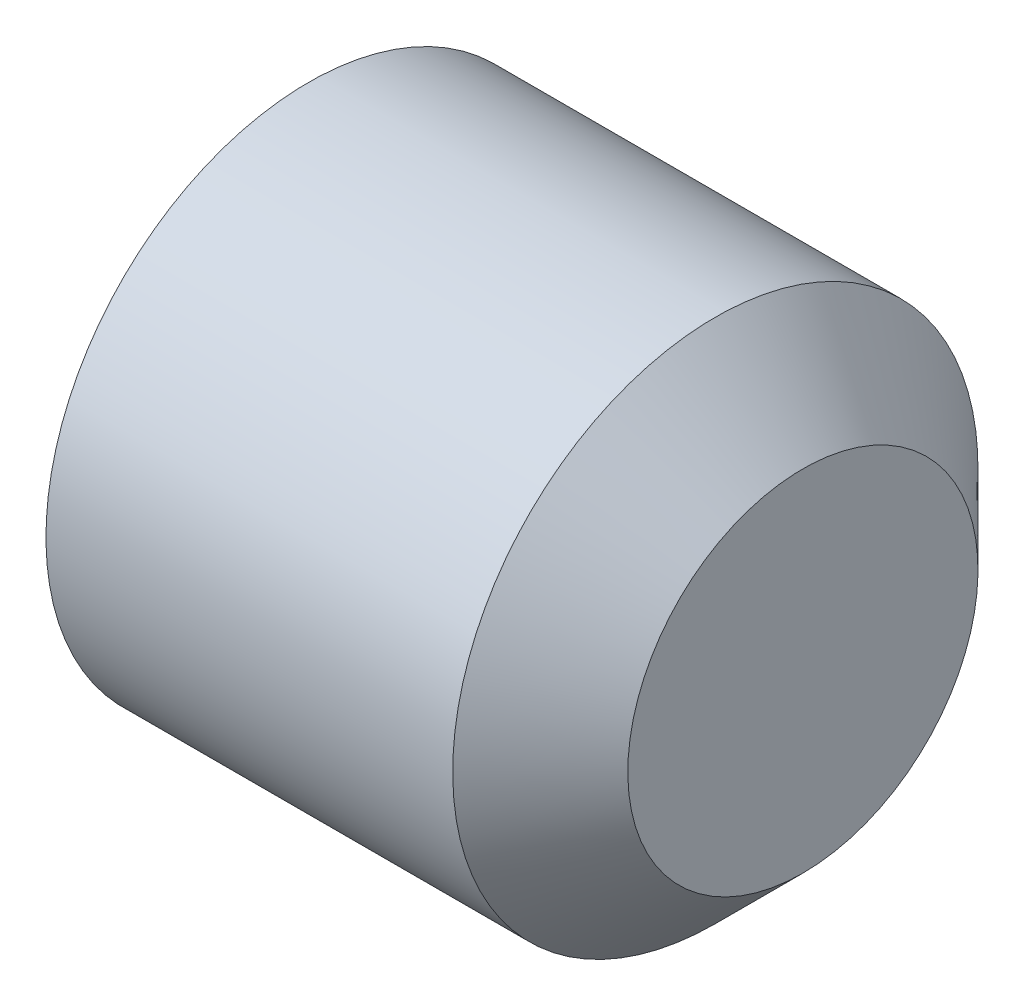
ISO-10303-21;
HEADER;
FILE_DESCRIPTION(('STEP AP214'),'2;1');
FILE_NAME('part.step','',(''),(''),'','','');
FILE_SCHEMA(('AUTOMOTIVE_DESIGN { 1 0 10303 214 1 1 1 1 }'));
ENDSEC;
DATA;
#1=APPLICATION_CONTEXT('core data for automotive mechanical design processes');
#2=APPLICATION_PROTOCOL_DEFINITION('international standard','automotive_design',2000,#1);
#3=PRODUCT_CONTEXT('',#1,'mechanical');
#4=PRODUCT('Part','Part','',(#3));
#5=PRODUCT_RELATED_PRODUCT_CATEGORY('part','',(#4));
#6=PRODUCT_DEFINITION_FORMATION('','',#4);
#7=PRODUCT_DEFINITION_CONTEXT('part definition',#1,'design');
#8=PRODUCT_DEFINITION('design','',#6,#7);
#9=PRODUCT_DEFINITION_SHAPE('','',#8);
#10=(LENGTH_UNIT() NAMED_UNIT(*) SI_UNIT(.MILLI.,.METRE.));
#11=(NAMED_UNIT(*) PLANE_ANGLE_UNIT() SI_UNIT($,.RADIAN.));
#12=(NAMED_UNIT(*) SI_UNIT($,.STERADIAN.) SOLID_ANGLE_UNIT());
#13=UNCERTAINTY_MEASURE_WITH_UNIT(LENGTH_MEASURE(1.E-05),#10,'distance_accuracy_value','');
#14=(GEOMETRIC_REPRESENTATION_CONTEXT(3) GLOBAL_UNCERTAINTY_ASSIGNED_CONTEXT((#13)) GLOBAL_UNIT_ASSIGNED_CONTEXT((#10,
#11,#12)) REPRESENTATION_CONTEXT('',''));
#15=CARTESIAN_POINT('',(0.,0.,0.));
#16=DIRECTION('',(0.,0.,1.));
#17=DIRECTION('',(1.,0.,0.));
#18=AXIS2_PLACEMENT_3D('',#15,#16,#17);
#19=CARTESIAN_POINT('',(0.5,0.,0.));
#20=DIRECTION('',(-1.,0.,0.));
#21=DIRECTION('',(0.,-1.,0.));
#22=AXIS2_PLACEMENT_3D('',#19,#20,#21);
#23=CONICAL_SURFACE('',#22,0.,1.0471975511966);
#24=CARTESIAN_POINT('',(0.,0.,0.));
#25=DIRECTION('',(-1.,0.,0.));
#26=DIRECTION('',(0.,-1.,0.));
#27=AXIS2_PLACEMENT_3D('',#24,#25,#26);
#28=CIRCLE('',#27,0.86602540378444);
#29=CARTESIAN_POINT('',(0.,0.,0.86602540378444));
#30=VERTEX_POINT('',#29);
#31=CARTESIAN_POINT('',(0.,0.75,0.433012701892222));
#32=VERTEX_POINT('',#31);
#33=EDGE_CURVE('E133',#30,#32,#28,.T.);
#34=ORIENTED_EDGE('',*,*,#33,.T.);
#35=CARTESIAN_POINT('',(-6.66799982216302E-05,0.7502,0.432897231838382));
#36=CARTESIAN_POINT('',(0.0109279672545947,0.717238666576004,0.451927466563575));
#37=CARTESIAN_POINT('',(0.0209278588304373,0.68399281869625,0.471121965786389));
#38=CARTESIAN_POINT('',(0.038384288073924,0.616925218141244,0.509843463020724));
#39=CARTESIAN_POINT('',(0.0458346476710156,0.583102272153654,0.529371149991445));
#40=CARTESIAN_POINT('',(0.0574342962607426,0.515875632570363,0.568184468451572));
#41=CARTESIAN_POINT('',(0.0616607517951379,0.482482293499614,0.58746412175321));
#42=CARTESIAN_POINT('',(0.0667098540533308,0.415538173911306,0.626114327218181));
#43=CARTESIAN_POINT('',(0.0675366780658326,0.381987637355588,0.645484738530082));
#44=CARTESIAN_POINT('',(0.065833231960248,0.319275698978884,0.681691493033275));
#45=CARTESIAN_POINT('',(0.0637212206264606,0.290104995811374,0.698533206359488));
#46=CARTESIAN_POINT('',(0.0570222121958374,0.231953671848458,0.73210688890321));
#47=CARTESIAN_POINT('',(0.0524329180465318,0.202973252776875,0.748838741655417));
#48=CARTESIAN_POINT('',(0.0409580031195664,0.144701650655193,0.782481866826481));
#49=CARTESIAN_POINT('',(0.0340236523302114,0.115417857581381,0.79938887264054));
#50=CARTESIAN_POINT('',(0.0182846224056368,0.0572874895838319,0.832950456252017));
#51=CARTESIAN_POINT('',(0.00948365081374576,0.0284401676519287,0.849605465334801));
#52=CARTESIAN_POINT('',(-6.66799982220191E-05,-0.000199999999999903,0.866140873838278));
#53=B_SPLINE_CURVE_WITH_KNOTS('',3,(#35,#36,#37,#38,#39,#40,#41,#42,#43,#44,#45,#46,#47,#48,#49,
#50,#51,#52),.UNSPECIFIED.,.F.,.F.,(4,2,2,2,2,2,2,2,4),(0.,0.118896819359341,0.238079744533805,
0.354311719456401,0.470400831872515,0.571553114284105,0.672799351342655,0.776293900714049,
0.87958477934405),.UNSPECIFIED.);
#54=EDGE_CURVE('E11',#32,#30,#53,.T.);
#55=ORIENTED_EDGE('',*,*,#54,.T.);
#56=EDGE_LOOP('',(#34,#55));
#57=FACE_BOUND('',#56,.T.);
#58=ADVANCED_FACE('F31',(#57),#23,.F.);
#59=CARTESIAN_POINT('',(0.,-0.75,0.43301270189222));
#60=VERTEX_POINT('',#59);
#61=EDGE_CURVE('E129',#60,#30,#28,.T.);
#62=ORIENTED_EDGE('',*,*,#61,.T.);
#63=CARTESIAN_POINT('',(-6.66799982221631E-05,0.000200000000000009,0.866140873838278));
#64=CARTESIAN_POINT('',(0.0109279672545943,-0.0327613334239957,0.847110639113085));
#65=CARTESIAN_POINT('',(0.0209278588304369,-0.0660071813037502,0.827916139890271));
#66=CARTESIAN_POINT('',(0.0383842880739238,-0.133074781858756,0.789194642655936));
#67=CARTESIAN_POINT('',(0.0458346476710154,-0.166897727846346,0.769666955685215));
#68=CARTESIAN_POINT('',(0.0574342962607425,-0.234124367429637,0.730853637225088));
#69=CARTESIAN_POINT('',(0.0616607517951379,-0.267517706500387,0.71157398392345));
#70=CARTESIAN_POINT('',(0.0667098540533308,-0.334461826088694,0.672923778458478));
#71=CARTESIAN_POINT('',(0.0675366780658327,-0.368012362644413,0.653553367146578));
#72=CARTESIAN_POINT('',(0.0658332319602481,-0.430724301021117,0.617346612643384));
#73=CARTESIAN_POINT('',(0.0637212206264609,-0.459895004188626,0.600504899317172));
#74=CARTESIAN_POINT('',(0.0570222121958376,-0.518046328151543,0.566931216773449));
#75=CARTESIAN_POINT('',(0.0524329180465321,-0.547026747223125,0.550199364021243));
#76=CARTESIAN_POINT('',(0.0409580031195668,-0.605298349344807,0.516556238850179));
#77=CARTESIAN_POINT('',(0.0340236523302119,-0.634582142418619,0.49964923303612));
#78=CARTESIAN_POINT('',(0.0182846224056374,-0.692712510416168,0.466087649424643));
#79=CARTESIAN_POINT('',(0.00948365081374636,-0.721559832348072,0.449432640341859));
#80=CARTESIAN_POINT('',(-6.6679998221416E-05,-0.7502,0.432897231838382));
#81=B_SPLINE_CURVE_WITH_KNOTS('',3,(#63,#64,#65,#66,#67,#68,#69,#70,#71,#72,#73,#74,#75,#76,#77,
#78,#79,#80),.UNSPECIFIED.,.F.,.F.,(4,2,2,2,2,2,2,2,4),(0.,0.118896819359341,0.238079744533806,
0.354311719456402,0.470400831872516,0.571553114284106,0.672799351342656,0.776293900714049,
0.87958477934405),.UNSPECIFIED.);
#82=EDGE_CURVE('E44',#30,#60,#81,.T.);
#83=ORIENTED_EDGE('',*,*,#82,.T.);
#84=EDGE_LOOP('',(#62,#83));
#85=FACE_BOUND('',#84,.T.);
#86=ADVANCED_FACE('F199',(#85),#23,.F.);
#87=CARTESIAN_POINT('',(0.,-0.75,-0.43301270189222));
#88=VERTEX_POINT('',#87);
#89=EDGE_CURVE('E128',#88,#60,#28,.T.);
#90=ORIENTED_EDGE('',*,*,#89,.T.);
#91=CARTESIAN_POINT('',(-0.278876466554599,-0.75,-1.1213588410753));
#92=CARTESIAN_POINT('',(-0.263336265513847,-0.75,-1.08897094569566));
#93=CARTESIAN_POINT('',(-0.247960254101356,-0.75,-1.05650461769235));
#94=CARTESIAN_POINT('',(-0.217622574828427,-0.75,-0.991372108674821));
#95=CARTESIAN_POINT('',(-0.202660981535683,-0.75,-0.958705892968621));
#96=CARTESIAN_POINT('',(-0.158358865523063,-0.75,-0.859967547804008));
#97=CARTESIAN_POINT('',(-0.129789394165184,-0.75,-0.793542929389712));
#98=CARTESIAN_POINT('',(-0.0751843648621228,-0.75,-0.657624750625179));
#99=CARTESIAN_POINT('',(-0.0492343798449783,-0.75,-0.588096337629301));
#100=CARTESIAN_POINT('',(-0.00305510516041329,-0.75,-0.4472488091812));
#101=CARTESIAN_POINT('',(0.0171890364428777,-0.75,-0.375934878791921));
#102=CARTESIAN_POINT('',(0.0406681724723913,-0.75,-0.267524989845908));
#103=CARTESIAN_POINT('',(0.047343676087413,-0.75,-0.23118312239164));
#104=CARTESIAN_POINT('',(0.0579431761785595,-0.75,-0.15809165305082));
#105=CARTESIAN_POINT('',(0.0618673585946982,-0.75,-0.121342078888484));
#106=CARTESIAN_POINT('',(0.0666007642621427,-0.75,-0.0480795367926938));
#107=CARTESIAN_POINT('',(0.0674467462415029,-0.75,-0.0115690096358278));
#108=CARTESIAN_POINT('',(0.0660502662725582,-0.75,0.0613915172782877));
#109=CARTESIAN_POINT('',(0.0638076130857623,-0.75,0.0978415131477214));
#110=CARTESIAN_POINT('',(0.0546612587546505,-0.75,0.187777191706421));
#111=CARTESIAN_POINT('',(0.0460435794249811,-0.75,0.241088938334563));
#112=CARTESIAN_POINT('',(0.0238197624153013,-0.75,0.346671776891812));
#113=CARTESIAN_POINT('',(0.0102076124427648,-0.75,0.398941534194197));
#114=CARTESIAN_POINT('',(-0.0209022912180242,-0.75,0.503561794942341));
#115=CARTESIAN_POINT('',(-0.0384803755428799,-0.75,0.555887795146071));
#116=CARTESIAN_POINT('',(-0.0761733658266929,-0.75,0.659578738588569));
#117=CARTESIAN_POINT('',(-0.0962873812846859,-0.75,0.710944011954183));
#118=CARTESIAN_POINT('',(-0.150040559931433,-0.75,0.841609169334977));
#119=CARTESIAN_POINT('',(-0.184929491266454,-0.75,0.92038989884234));
#120=CARTESIAN_POINT('',(-0.257158245348334,-0.75,1.07682093489163));
#121=CARTESIAN_POINT('',(-0.294498696792946,-0.75,1.15447094517097));
#122=CARTESIAN_POINT('',(-0.370753350440448,-0.75,1.30910230028642));
#123=CARTESIAN_POINT('',(-0.409669312305082,-0.75,1.38608277390296));
#124=CARTESIAN_POINT('',(-0.488505273193592,-0.75,1.53952831971992));
#125=CARTESIAN_POINT('',(-0.528425305368566,-0.75,1.61599337479695));
#126=CARTESIAN_POINT('',(-0.6051521411833,-0.75,1.76135282602859));
#127=CARTESIAN_POINT('',(-0.641896830705147,-0.75,1.83028007942956));
#128=CARTESIAN_POINT('',(-0.715804702425086,-0.75,1.9679128537899));
#129=CARTESIAN_POINT('',(-0.752967900110791,-0.75,2.0366183664215));
#130=CARTESIAN_POINT('',(-0.827513082986854,-0.75,2.17368403451686));
#131=CARTESIAN_POINT('',(-0.864894271247797,-0.75,2.24204462391346));
#132=CARTESIAN_POINT('',(-0.939899942981136,-0.75,2.37862759491475));
#133=CARTESIAN_POINT('',(-0.977524413618781,-0.75,2.44684998356505));
#134=CARTESIAN_POINT('',(-1.01523807504823,-0.75,2.51502271803409));
#135=B_SPLINE_CURVE_WITH_KNOTS('',3,(#91,#92,#93,#94,#95,#96,#97,#98,#99,#100,#101,#102,#103,
#104,#105,#106,#107,#108,#109,#110,#111,#112,#113,#114,#115,#116,#117,#118,#119,#120,#121,#122,
#123,#124,#125,#126,#127,#128,#129,#130,#131,#132,#133,#134),.UNSPECIFIED.,.F.,.F.,(4,2,2,2,2,2,
2,2,2,2,2,2,2,2,2,2,2,2,2,2,2,4),(0.,0.107767756928781,0.215554780551915,0.432420251910877,
0.654944617818952,0.876884302501297,0.987647541221339,1.0984032936094,1.20783201912744,
1.31726752042964,1.47894399847128,1.64081574297878,1.8063195007273,1.97176530228984,
2.23016383407581,2.48862889356041,2.74739105429863,3.00616176975601,3.24048926348677,
3.47482545759373,3.70856560604661,3.94229352217274),.UNSPECIFIED.);
#136=EDGE_CURVE('E175',#60,#88,#135,.F.);
#137=ORIENTED_EDGE('',*,*,#136,.T.);
#138=EDGE_LOOP('',(#90,#137));
#139=FACE_BOUND('',#138,.T.);
#140=ADVANCED_FACE('F205',(#139),#23,.F.);
#141=CARTESIAN_POINT('',(0.,0.,-0.86602540378444));
#142=VERTEX_POINT('',#141);
#143=EDGE_CURVE('E227',#142,#88,#28,.T.);
#144=ORIENTED_EDGE('',*,*,#143,.T.);
#145=CARTESIAN_POINT('',(-6.66799982214356E-05,-0.7502,-0.432897231838382));
#146=CARTESIAN_POINT('',(0.0109279672545948,-0.717238666576004,-0.451927466563575));
#147=CARTESIAN_POINT('',(0.0209278588304374,-0.68399281869625,-0.471121965786389));
#148=CARTESIAN_POINT('',(0.0383842880739242,-0.616925218141244,-0.509843463020724));
#149=CARTESIAN_POINT('',(0.0458346476710158,-0.583102272153654,-0.529371149991445));
#150=CARTESIAN_POINT('',(0.0574342962607427,-0.515875632570363,-0.568184468451572));
#151=CARTESIAN_POINT('',(0.061660751795138,-0.482482293499614,-0.58746412175321));
#152=CARTESIAN_POINT('',(0.0667098540533309,-0.415538173911306,-0.626114327218181));
#153=CARTESIAN_POINT('',(0.0675366780658328,-0.381987637355587,-0.645484738530082));
#154=CARTESIAN_POINT('',(0.0658332319602481,-0.319275698978883,-0.681691493033275));
#155=CARTESIAN_POINT('',(0.0637212206264607,-0.290104995811374,-0.698533206359488));
#156=CARTESIAN_POINT('',(0.0570222121958373,-0.231953671848458,-0.732106888903211));
#157=CARTESIAN_POINT('',(0.0524329180465317,-0.202973252776875,-0.748838741655417));
#158=CARTESIAN_POINT('',(0.0409580031195663,-0.144701650655193,-0.782481866826481));
#159=CARTESIAN_POINT('',(0.0340236523302114,-0.115417857581381,-0.79938887264054));
#160=CARTESIAN_POINT('',(0.0182846224056368,-0.0572874895838316,-0.832950456252017));
#161=CARTESIAN_POINT('',(0.00948365081374577,-0.0284401676519285,-0.849605465334801));
#162=CARTESIAN_POINT('',(-6.66799982221086E-05,0.000200000000000049,-0.866140873838278));
#163=B_SPLINE_CURVE_WITH_KNOTS('',3,(#145,#146,#147,#148,#149,#150,#151,#152,#153,#154,#155,
#156,#157,#158,#159,#160,#161,#162),.UNSPECIFIED.,.F.,.F.,(4,2,2,2,2,2,2,2,4),(0.,
0.118896819359341,0.238079744533805,0.354311719456401,0.470400831872516,0.571553114284106,
0.672799351342655,0.776293900714049,0.87958477934405),.UNSPECIFIED.);
#164=EDGE_CURVE('E170',#88,#142,#163,.T.);
#165=ORIENTED_EDGE('',*,*,#164,.T.);
#166=EDGE_LOOP('',(#144,#165));
#167=FACE_BOUND('',#166,.T.);
#168=ADVANCED_FACE('F217',(#167),#23,.F.);
#169=CARTESIAN_POINT('',(0.,0.75,-0.43301270189222));
#170=VERTEX_POINT('',#169);
#171=EDGE_CURVE('E225',#170,#142,#28,.T.);
#172=ORIENTED_EDGE('',*,*,#171,.T.);
#173=CARTESIAN_POINT('',(-6.66799982221631E-05,-0.000200000000000009,-0.866140873838278));
#174=CARTESIAN_POINT('',(0.0109279672545942,0.0327613334239957,-0.847110639113085));
#175=CARTESIAN_POINT('',(0.0209278588304369,0.0660071813037503,-0.827916139890271));
#176=CARTESIAN_POINT('',(0.0383842880739237,0.133074781858756,-0.789194642655936));
#177=CARTESIAN_POINT('',(0.0458346476710154,0.166897727846346,-0.769666955685215));
#178=CARTESIAN_POINT('',(0.0574342962607424,0.234124367429637,-0.730853637225088));
#179=CARTESIAN_POINT('',(0.0616607517951378,0.267517706500387,-0.71157398392345));
#180=CARTESIAN_POINT('',(0.0667098540533307,0.334461826088694,-0.672923778458478));
#181=CARTESIAN_POINT('',(0.0675366780658325,0.368012362644413,-0.653553367146578));
#182=CARTESIAN_POINT('',(0.065833231960248,0.430724301021117,-0.617346612643384));
#183=CARTESIAN_POINT('',(0.0637212206264608,0.459895004188626,-0.600504899317172));
#184=CARTESIAN_POINT('',(0.0570222121958376,0.518046328151543,-0.566931216773449));
#185=CARTESIAN_POINT('',(0.052432918046532,0.547026747223125,-0.550199364021243));
#186=CARTESIAN_POINT('',(0.0409580031195667,0.605298349344807,-0.516556238850179));
#187=CARTESIAN_POINT('',(0.0340236523302118,0.63458214241862,-0.49964923303612));
#188=CARTESIAN_POINT('',(0.0182846224056372,0.692712510416168,-0.466087649424643));
#189=CARTESIAN_POINT('',(0.00948365081374617,0.721559832348071,-0.449432640341859));
#190=CARTESIAN_POINT('',(-6.66799982216486E-05,0.7502,-0.432897231838382));
#191=B_SPLINE_CURVE_WITH_KNOTS('',3,(#173,#174,#175,#176,#177,#178,#179,#180,#181,#182,#183,
#184,#185,#186,#187,#188,#189,#190),.UNSPECIFIED.,.F.,.F.,(4,2,2,2,2,2,2,2,4),(0.,
0.118896819359341,0.238079744533806,0.354311719456402,0.470400831872516,0.571553114284106,
0.672799351342656,0.776293900714049,0.87958477934405),.UNSPECIFIED.);
#192=EDGE_CURVE('E111',#142,#170,#191,.T.);
#193=ORIENTED_EDGE('',*,*,#192,.T.);
#194=EDGE_LOOP('',(#172,#193));
#195=FACE_BOUND('',#194,.T.);
#196=ADVANCED_FACE('F209',(#195),#23,.F.);
#197=EDGE_CURVE('E221',#32,#170,#28,.T.);
#198=ORIENTED_EDGE('',*,*,#197,.T.);
#199=CARTESIAN_POINT('',(-0.278876466554599,0.75,-1.1213588410753));
#200=CARTESIAN_POINT('',(-0.263336265513847,0.75,-1.08897094569566));
#201=CARTESIAN_POINT('',(-0.247960254101356,0.75,-1.05650461769235));
#202=CARTESIAN_POINT('',(-0.217622574828427,0.75,-0.99137210867482));
#203=CARTESIAN_POINT('',(-0.202660981535683,0.75,-0.958705892968621));
#204=CARTESIAN_POINT('',(-0.158358865523063,0.75,-0.859967547804008));
#205=CARTESIAN_POINT('',(-0.129789394165184,0.75,-0.793542929389712));
#206=CARTESIAN_POINT('',(-0.0751843648621231,0.75,-0.657624750625179));
#207=CARTESIAN_POINT('',(-0.0492343798449785,0.75,-0.588096337629301));
#208=CARTESIAN_POINT('',(-0.0030551051604135,0.75,-0.4472488091812));
#209=CARTESIAN_POINT('',(0.0171890364428774,0.75,-0.375934878791921));
#210=CARTESIAN_POINT('',(0.0406681724723912,0.75,-0.267524989845908));
#211=CARTESIAN_POINT('',(0.0473436760874129,0.75,-0.23118312239164));
#212=CARTESIAN_POINT('',(0.0579431761785593,0.75,-0.15809165305082));
#213=CARTESIAN_POINT('',(0.061867358594698,0.75,-0.121342078888484));
#214=CARTESIAN_POINT('',(0.0666007642621425,0.75,-0.0480795367926938));
#215=CARTESIAN_POINT('',(0.0674467462415028,0.75,-0.0115690096358278));
#216=CARTESIAN_POINT('',(0.0660502662725581,0.75,0.0613915172782877));
#217=CARTESIAN_POINT('',(0.0638076130857623,0.75,0.0978415131477215));
#218=CARTESIAN_POINT('',(0.0546612587546504,0.75,0.187777191706421));
#219=CARTESIAN_POINT('',(0.0460435794249809,0.75,0.241088938334563));
#220=CARTESIAN_POINT('',(0.023819762415301,0.75,0.346671776891812));
#221=CARTESIAN_POINT('',(0.0102076124427646,0.75,0.398941534194198));
#222=CARTESIAN_POINT('',(-0.0209022912180244,0.75,0.503561794942341));
#223=CARTESIAN_POINT('',(-0.0384803755428802,0.75,0.555887795146071));
#224=CARTESIAN_POINT('',(-0.0761733658266932,0.75,0.659578738588569));
#225=CARTESIAN_POINT('',(-0.0962873812846861,0.75,0.710944011954183));
#226=CARTESIAN_POINT('',(-0.150040559931434,0.75,0.841609169334977));
#227=CARTESIAN_POINT('',(-0.184929491266455,0.75,0.92038989884234));
#228=CARTESIAN_POINT('',(-0.257158245348335,0.75,1.07682093489163));
#229=CARTESIAN_POINT('',(-0.294498696792946,0.75,1.15447094517097));
#230=CARTESIAN_POINT('',(-0.370753350440449,0.75,1.30910230028643));
#231=CARTESIAN_POINT('',(-0.409669312305082,0.75,1.38608277390296));
#232=CARTESIAN_POINT('',(-0.488505273193592,0.75,1.53952831971992));
#233=CARTESIAN_POINT('',(-0.528425305368567,0.75,1.61599337479695));
#234=CARTESIAN_POINT('',(-0.605152141183301,0.75,1.76135282602859));
#235=CARTESIAN_POINT('',(-0.641896830705147,0.75,1.83028007942956));
#236=CARTESIAN_POINT('',(-0.715804702425086,0.75,1.9679128537899));
#237=CARTESIAN_POINT('',(-0.752967900110792,0.75,2.0366183664215));
#238=CARTESIAN_POINT('',(-0.827513082986854,0.75,2.17368403451686));
#239=CARTESIAN_POINT('',(-0.864894271247797,0.75,2.24204462391346));
#240=CARTESIAN_POINT('',(-0.939899942981136,0.75,2.37862759491475));
#241=CARTESIAN_POINT('',(-0.977524413618781,0.75,2.44684998356505));
#242=CARTESIAN_POINT('',(-1.01523807504823,0.75,2.51502271803409));
#243=B_SPLINE_CURVE_WITH_KNOTS('',3,(#199,#200,#201,#202,#203,#204,#205,#206,#207,#208,#209,
#210,#211,#212,#213,#214,#215,#216,#217,#218,#219,#220,#221,#222,#223,#224,#225,#226,#227,#228,
#229,#230,#231,#232,#233,#234,#235,#236,#237,#238,#239,#240,#241,#242),.UNSPECIFIED.,.F.,.F.,(4,
2,2,2,2,2,2,2,2,2,2,2,2,2,2,2,2,2,2,2,2,4),(0.,0.107767756928781,0.215554780551915,
0.432420251910877,0.654944617818951,0.876884302501296,0.987647541221338,1.0984032936094,
1.20783201912744,1.31726752042963,1.47894399847128,1.64081574297878,1.8063195007273,
1.97176530228984,2.23016383407581,2.48862889356041,2.74739105429863,3.00616176975601,
3.24048926348677,3.47482545759373,3.70856560604661,3.94229352217274),.UNSPECIFIED.);
#244=EDGE_CURVE('E77',#170,#32,#243,.T.);
#245=ORIENTED_EDGE('',*,*,#244,.T.);
#246=EDGE_LOOP('',(#198,#245));
#247=FACE_BOUND('',#246,.T.);
#248=ADVANCED_FACE('F201',(#247),#23,.F.);
#249=CARTESIAN_POINT('',(3.,0.,0.));
#250=DIRECTION('',(1.,0.,0.));
#251=DIRECTION('',(0.,1.,0.));
#252=AXIS2_PLACEMENT_3D('',#249,#250,#251);
#253=PLANE('',#252);
#254=CARTESIAN_POINT('',(3.,0.,0.));
#255=DIRECTION('',(-1.,0.,0.));
#256=DIRECTION('',(0.,-1.,0.));
#257=AXIS2_PLACEMENT_3D('',#254,#255,#256);
#258=CIRCLE('',#257,1.);
#259=CARTESIAN_POINT('',(3.,-1.,0.));
#260=VERTEX_POINT('',#259);
#261=EDGE_CURVE('E142',#260,#260,#258,.T.);
#262=ORIENTED_EDGE('',*,*,#261,.F.);
#263=EDGE_LOOP('',(#262));
#264=FACE_BOUND('',#263,.T.);
#265=ADVANCED_FACE('F33',(#264),#253,.T.);
#266=CARTESIAN_POINT('',(2.5,0.,0.));
#267=DIRECTION('',(-1.,0.,0.));
#268=DIRECTION('',(0.,-1.,0.));
#269=AXIS2_PLACEMENT_3D('',#266,#267,#268);
#270=CONICAL_SURFACE('',#269,1.5,0.785398163397448);
#271=ORIENTED_EDGE('',*,*,#261,.T.);
#272=EDGE_LOOP('',(#271));
#273=FACE_BOUND('',#272,.T.);
#274=CARTESIAN_POINT('',(2.5,0.,0.));
#275=DIRECTION('',(-1.,0.,0.));
#276=DIRECTION('',(0.,-1.,0.));
#277=AXIS2_PLACEMENT_3D('',#274,#275,#276);
#278=CIRCLE('',#277,1.5);
#279=CARTESIAN_POINT('',(2.5,-1.5,0.));
#280=VERTEX_POINT('',#279);
#281=EDGE_CURVE('E139',#280,#280,#278,.T.);
#282=ORIENTED_EDGE('',*,*,#281,.F.);
#283=EDGE_LOOP('',(#282));
#284=FACE_BOUND('',#283,.T.);
#285=ADVANCED_FACE('F215',(#273,#284),#270,.T.);
#286=CARTESIAN_POINT('',(0.5,0.,0.));
#287=DIRECTION('',(-1.,0.,0.));
#288=DIRECTION('',(0.,-1.,0.));
#289=AXIS2_PLACEMENT_3D('',#286,#287,#288);
#290=CYLINDRICAL_SURFACE('',#289,1.5);
#291=ORIENTED_EDGE('',*,*,#281,.T.);
#292=EDGE_LOOP('',(#291));
#293=FACE_BOUND('',#292,.T.);
#294=CARTESIAN_POINT('',(0.17695785750662,0.,0.));
#295=DIRECTION('',(-1.,0.,0.));
#296=DIRECTION('',(0.,-1.,0.));
#297=AXIS2_PLACEMENT_3D('',#294,#295,#296);
#298=CIRCLE('',#297,1.5);
#299=CARTESIAN_POINT('',(0.17695785750662,-1.5,0.));
#300=VERTEX_POINT('',#299);
#301=EDGE_CURVE('E136',#300,#300,#298,.T.);
#302=ORIENTED_EDGE('',*,*,#301,.F.);
#303=EDGE_LOOP('',(#302));
#304=FACE_BOUND('',#303,.T.);
#305=ADVANCED_FACE('F324',(#293,#304),#290,.T.);
#306=CARTESIAN_POINT('',(0.,0.,0.));
#307=DIRECTION('',(1.,0.,0.));
#308=DIRECTION('',(0.,1.,0.));
#309=AXIS2_PLACEMENT_3D('',#306,#307,#308);
#310=CONICAL_SURFACE('',#309,1.1935,1.0471975511966);
#311=ORIENTED_EDGE('',*,*,#301,.T.);
#312=EDGE_LOOP('',(#311));
#313=FACE_BOUND('',#312,.T.);
#314=CARTESIAN_POINT('',(0.,0.,0.));
#315=DIRECTION('',(-1.,0.,0.));
#316=DIRECTION('',(0.,-1.,0.));
#317=AXIS2_PLACEMENT_3D('',#314,#315,#316);
#318=CIRCLE('',#317,1.1935);
#319=CARTESIAN_POINT('',(0.,-1.1935,0.));
#320=VERTEX_POINT('',#319);
#321=EDGE_CURVE('E132',#320,#320,#318,.T.);
#322=ORIENTED_EDGE('',*,*,#321,.F.);
#323=EDGE_LOOP('',(#322));
#324=FACE_BOUND('',#323,.T.);
#325=ADVANCED_FACE('F196',(#313,#324),#310,.T.);
#326=CARTESIAN_POINT('',(0.,-1.1935,0.));
#327=DIRECTION('',(-1.,0.,0.));
#328=DIRECTION('',(0.,-1.,0.));
#329=AXIS2_PLACEMENT_3D('',#326,#327,#328);
#330=PLANE('',#329);
#331=ORIENTED_EDGE('',*,*,#321,.T.);
#332=EDGE_LOOP('',(#331));
#333=FACE_BOUND('',#332,.T.);
#334=ORIENTED_EDGE('',*,*,#61,.F.);
#335=ORIENTED_EDGE('',*,*,#89,.F.);
#336=ORIENTED_EDGE('',*,*,#143,.F.);
#337=ORIENTED_EDGE('',*,*,#171,.F.);
#338=ORIENTED_EDGE('',*,*,#197,.F.);
#339=ORIENTED_EDGE('',*,*,#33,.F.);
#340=EDGE_LOOP('',(#334,#335,#336,#337,#338,#339));
#341=FACE_BOUND('',#340,.T.);
#342=ADVANCED_FACE('F191',(#333,#341),#330,.T.);
#343=CARTESIAN_POINT('',(1.2,0.75,0.43301270189222));
#344=DIRECTION('',(0.,-0.500000000000001,-0.866025403784438));
#345=DIRECTION('',(0.,0.866025403784438,-0.500000000000001));
#346=AXIS2_PLACEMENT_3D('',#343,#344,#345);
#347=PLANE('',#346);
#348=DIRECTION('',(-1.,0.,0.));
#349=VECTOR('',#348,1.);
#350=CARTESIAN_POINT('',(1.2,0.75,0.43301270189222));
#351=LINE('',#350,#349);
#352=CARTESIAN_POINT('',(1.2,0.75,0.43301270189222));
#353=VERTEX_POINT('',#352);
#354=EDGE_CURVE('E51',#353,#32,#351,.T.);
#355=ORIENTED_EDGE('',*,*,#354,.F.);
#356=DIRECTION('',(0.,-0.866025403784438,0.500000000000001));
#357=VECTOR('',#356,1.);
#358=CARTESIAN_POINT('',(1.2,0.75,0.43301270189222));
#359=LINE('',#358,#357);
#360=CARTESIAN_POINT('',(1.2,0.,0.86602540378444));
#361=VERTEX_POINT('',#360);
#362=EDGE_CURVE('E237',#353,#361,#359,.T.);
#363=ORIENTED_EDGE('',*,*,#362,.T.);
#364=DIRECTION('',(-1.,0.,0.));
#365=VECTOR('',#364,1.);
#366=CARTESIAN_POINT('',(1.2,0.,0.86602540378444));
#367=LINE('',#366,#365);
#368=EDGE_CURVE('E125',#361,#30,#367,.T.);
#369=ORIENTED_EDGE('',*,*,#368,.T.);
#370=ORIENTED_EDGE('',*,*,#54,.F.);
#371=EDGE_LOOP('',(#355,#363,#369,#370));
#372=FACE_BOUND('',#371,.T.);
#373=ADVANCED_FACE('F187',(#372),#347,.T.);
#374=CARTESIAN_POINT('',(1.2,0.,0.86602540378444));
#375=DIRECTION('',(0.,0.500000000000001,-0.866025403784438));
#376=DIRECTION('',(0.,0.866025403784438,0.500000000000001));
#377=AXIS2_PLACEMENT_3D('',#374,#375,#376);
#378=PLANE('',#377);
#379=ORIENTED_EDGE('',*,*,#368,.F.);
#380=DIRECTION('',(0.,-0.866025403784438,-0.500000000000001));
#381=VECTOR('',#380,1.);
#382=CARTESIAN_POINT('',(1.2,0.,0.86602540378444));
#383=LINE('',#382,#381);
#384=CARTESIAN_POINT('',(1.2,-0.75,0.43301270189222));
#385=VERTEX_POINT('',#384);
#386=EDGE_CURVE('E86',#361,#385,#383,.T.);
#387=ORIENTED_EDGE('',*,*,#386,.T.);
#388=DIRECTION('',(-1.,0.,0.));
#389=VECTOR('',#388,1.);
#390=CARTESIAN_POINT('',(1.2,-0.75,0.43301270189222));
#391=LINE('',#390,#389);
#392=EDGE_CURVE('E122',#385,#60,#391,.T.);
#393=ORIENTED_EDGE('',*,*,#392,.T.);
#394=ORIENTED_EDGE('',*,*,#82,.F.);
#395=EDGE_LOOP('',(#379,#387,#393,#394));
#396=FACE_BOUND('',#395,.T.);
#397=ADVANCED_FACE('F184',(#396),#378,.T.);
#398=CARTESIAN_POINT('',(1.2,-0.75,0.43301270189222));
#399=DIRECTION('',(0.,1.,0.));
#400=DIRECTION('',(0.,0.,1.));
#401=AXIS2_PLACEMENT_3D('',#398,#399,#400);
#402=PLANE('',#401);
#403=ORIENTED_EDGE('',*,*,#392,.F.);
#404=DIRECTION('',(0.,0.,-1.));
#405=VECTOR('',#404,1.);
#406=CARTESIAN_POINT('',(1.2,-0.75,0.43301270189222));
#407=LINE('',#406,#405);
#408=CARTESIAN_POINT('',(1.2,-0.75,-0.43301270189222));
#409=VERTEX_POINT('',#408);
#410=EDGE_CURVE('E106',#385,#409,#407,.T.);
#411=ORIENTED_EDGE('',*,*,#410,.T.);
#412=DIRECTION('',(-1.,0.,0.));
#413=VECTOR('',#412,1.);
#414=CARTESIAN_POINT('',(1.2,-0.75,-0.43301270189222));
#415=LINE('',#414,#413);
#416=EDGE_CURVE('E103',#409,#88,#415,.T.);
#417=ORIENTED_EDGE('',*,*,#416,.T.);
#418=ORIENTED_EDGE('',*,*,#136,.F.);
#419=EDGE_LOOP('',(#403,#411,#417,#418));
#420=FACE_BOUND('',#419,.T.);
#421=ADVANCED_FACE('F167',(#420),#402,.T.);
#422=CARTESIAN_POINT('',(1.2,-0.75,-0.43301270189222));
#423=DIRECTION('',(0.,0.500000000000001,0.866025403784438));
#424=DIRECTION('',(0.,-0.866025403784438,0.500000000000001));
#425=AXIS2_PLACEMENT_3D('',#422,#423,#424);
#426=PLANE('',#425);
#427=ORIENTED_EDGE('',*,*,#416,.F.);
#428=DIRECTION('',(0.,0.866025403784438,-0.500000000000001));
#429=VECTOR('',#428,1.);
#430=CARTESIAN_POINT('',(1.2,-0.75,-0.43301270189222));
#431=LINE('',#430,#429);
#432=CARTESIAN_POINT('',(1.2,0.,-0.86602540378444));
#433=VERTEX_POINT('',#432);
#434=EDGE_CURVE('E97',#409,#433,#431,.T.);
#435=ORIENTED_EDGE('',*,*,#434,.T.);
#436=DIRECTION('',(-1.,0.,0.));
#437=VECTOR('',#436,1.);
#438=CARTESIAN_POINT('',(1.2,0.,-0.86602540378444));
#439=LINE('',#438,#437);
#440=EDGE_CURVE('E100',#433,#142,#439,.T.);
#441=ORIENTED_EDGE('',*,*,#440,.T.);
#442=ORIENTED_EDGE('',*,*,#164,.F.);
#443=EDGE_LOOP('',(#427,#435,#441,#442));
#444=FACE_BOUND('',#443,.T.);
#445=ADVANCED_FACE('F99',(#444),#426,.T.);
#446=CARTESIAN_POINT('',(1.2,0.,-0.86602540378444));
#447=DIRECTION('',(0.,-0.500000000000001,0.866025403784438));
#448=DIRECTION('',(0.,-0.866025403784438,-0.500000000000001));
#449=AXIS2_PLACEMENT_3D('',#446,#447,#448);
#450=PLANE('',#449);
#451=ORIENTED_EDGE('',*,*,#440,.F.);
#452=DIRECTION('',(0.,0.866025403784438,0.500000000000001));
#453=VECTOR('',#452,1.);
#454=CARTESIAN_POINT('',(1.2,0.,-0.86602540378444));
#455=LINE('',#454,#453);
#456=CARTESIAN_POINT('',(1.2,0.75,-0.43301270189222));
#457=VERTEX_POINT('',#456);
#458=EDGE_CURVE('E105',#433,#457,#455,.T.);
#459=ORIENTED_EDGE('',*,*,#458,.T.);
#460=DIRECTION('',(-1.,0.,0.));
#461=VECTOR('',#460,1.);
#462=CARTESIAN_POINT('',(1.2,0.75,-0.43301270189222));
#463=LINE('',#462,#461);
#464=EDGE_CURVE('E112',#457,#170,#463,.T.);
#465=ORIENTED_EDGE('',*,*,#464,.T.);
#466=ORIENTED_EDGE('',*,*,#192,.F.);
#467=EDGE_LOOP('',(#451,#459,#465,#466));
#468=FACE_BOUND('',#467,.T.);
#469=ADVANCED_FACE('F109',(#468),#450,.T.);
#470=CARTESIAN_POINT('',(1.2,0.75,-0.43301270189222));
#471=DIRECTION('',(0.,-1.,0.));
#472=DIRECTION('',(0.,0.,-1.));
#473=AXIS2_PLACEMENT_3D('',#470,#471,#472);
#474=PLANE('',#473);
#475=ORIENTED_EDGE('',*,*,#464,.F.);
#476=DIRECTION('',(0.,0.,1.));
#477=VECTOR('',#476,1.);
#478=CARTESIAN_POINT('',(1.2,0.75,-0.43301270189222));
#479=LINE('',#478,#477);
#480=EDGE_CURVE('E57',#457,#353,#479,.T.);
#481=ORIENTED_EDGE('',*,*,#480,.T.);
#482=ORIENTED_EDGE('',*,*,#354,.T.);
#483=ORIENTED_EDGE('',*,*,#244,.F.);
#484=EDGE_LOOP('',(#475,#481,#482,#483));
#485=FACE_BOUND('',#484,.T.);
#486=ADVANCED_FACE('F157',(#485),#474,.T.);
#487=CARTESIAN_POINT('',(1.2,0.,0.86602540378444));
#488=DIRECTION('',(1.,0.,0.));
#489=DIRECTION('',(0.,0.,-1.));
#490=AXIS2_PLACEMENT_3D('',#487,#488,#489);
#491=PLANE('',#490);
#492=ORIENTED_EDGE('',*,*,#362,.F.);
#493=ORIENTED_EDGE('',*,*,#480,.F.);
#494=ORIENTED_EDGE('',*,*,#458,.F.);
#495=ORIENTED_EDGE('',*,*,#434,.F.);
#496=ORIENTED_EDGE('',*,*,#410,.F.);
#497=ORIENTED_EDGE('',*,*,#386,.F.);
#498=EDGE_LOOP('',(#492,#493,#494,#495,#496,#497));
#499=FACE_BOUND('',#498,.T.);
#500=ADVANCED_FACE('F114',(#499),#491,.F.);
#501=CLOSED_SHELL('',(#58,#86,#140,#168,#196,#248,#265,#285,#305,#325,#342,#373,#397,#421,#445,
#469,#486,#500));
#502=MANIFOLD_SOLID_BREP('B2',#501);
#503=ADVANCED_BREP_SHAPE_REPRESENTATION('',(#18,#502),#14);
#504=SHAPE_DEFINITION_REPRESENTATION(#9,#503);
ENDSEC;
END-ISO-10303-21;
